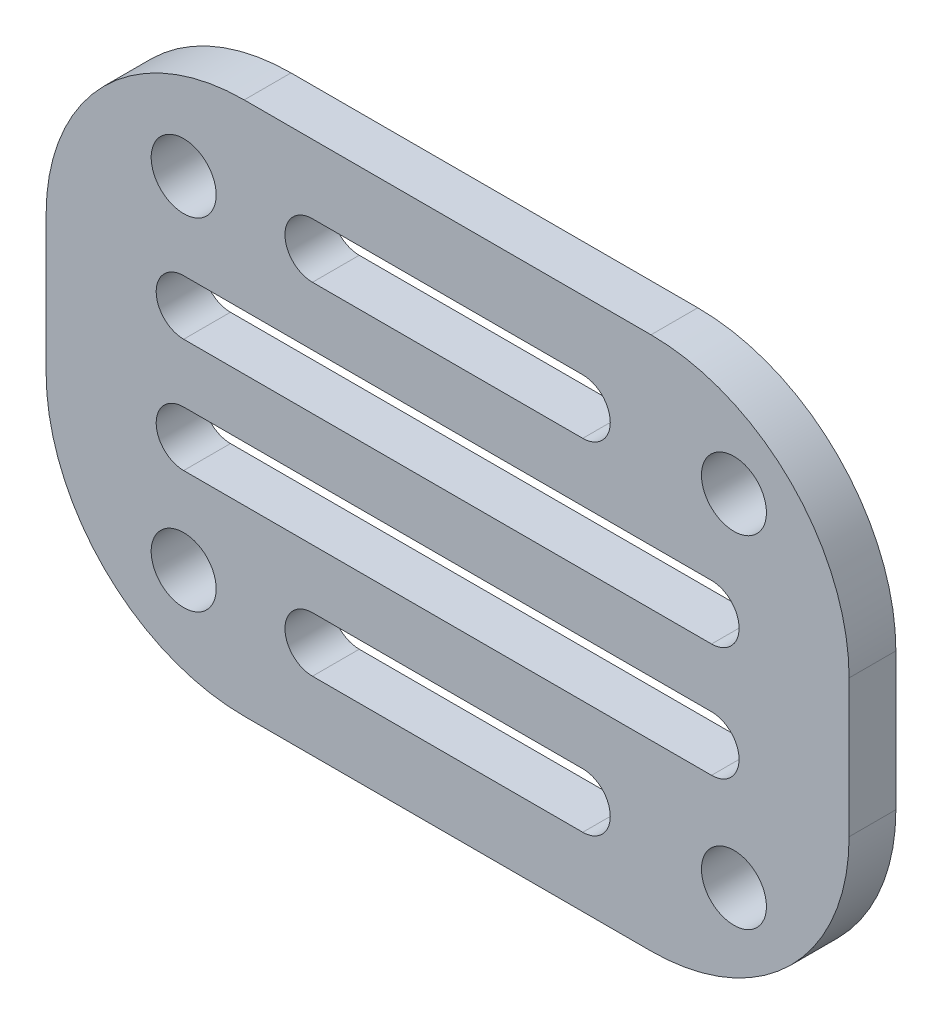
ISO-10303-21;
HEADER;
FILE_DESCRIPTION(('STEP AP214'),'2;1');
FILE_NAME('part.step','',(''),(''),'','','');
FILE_SCHEMA(('AUTOMOTIVE_DESIGN { 1 0 10303 214 1 1 1 1 }'));
ENDSEC;
DATA;
#1=APPLICATION_CONTEXT('core data for automotive mechanical design processes');
#2=APPLICATION_PROTOCOL_DEFINITION('international standard','automotive_design',2000,#1);
#3=PRODUCT_CONTEXT('',#1,'mechanical');
#4=PRODUCT('Part','Part','',(#3));
#5=PRODUCT_RELATED_PRODUCT_CATEGORY('part','',(#4));
#6=PRODUCT_DEFINITION_FORMATION('','',#4);
#7=PRODUCT_DEFINITION_CONTEXT('part definition',#1,'design');
#8=PRODUCT_DEFINITION('design','',#6,#7);
#9=PRODUCT_DEFINITION_SHAPE('','',#8);
#10=(LENGTH_UNIT() NAMED_UNIT(*) SI_UNIT(.MILLI.,.METRE.));
#11=(NAMED_UNIT(*) PLANE_ANGLE_UNIT() SI_UNIT($,.RADIAN.));
#12=(NAMED_UNIT(*) SI_UNIT($,.STERADIAN.) SOLID_ANGLE_UNIT());
#13=UNCERTAINTY_MEASURE_WITH_UNIT(LENGTH_MEASURE(1.E-05),#10,'distance_accuracy_value','');
#14=(GEOMETRIC_REPRESENTATION_CONTEXT(3) GLOBAL_UNCERTAINTY_ASSIGNED_CONTEXT((#13)) GLOBAL_UNIT_ASSIGNED_CONTEXT((#10,
#11,#12)) REPRESENTATION_CONTEXT('',''));
#15=CARTESIAN_POINT('',(0.,0.,0.));
#16=DIRECTION('',(0.,0.,1.));
#17=DIRECTION('',(1.,0.,0.));
#18=AXIS2_PLACEMENT_3D('',#15,#16,#17);
#19=CARTESIAN_POINT('',(-19.05,0.,2.159));
#20=DIRECTION('',(1.,0.,0.));
#21=DIRECTION('',(0.,0.,-1.));
#22=AXIS2_PLACEMENT_3D('',#19,#20,#21);
#23=PLANE('',#22);
#24=DIRECTION('',(0.,-1.,0.));
#25=VECTOR('',#24,1.);
#26=CARTESIAN_POINT('',(-19.05,0.,0.));
#27=LINE('',#26,#25);
#28=CARTESIAN_POINT('',(-19.05,3.17499999999999,0.));
#29=VERTEX_POINT('',#28);
#30=CARTESIAN_POINT('',(-19.05,-3.17499999999999,0.));
#31=VERTEX_POINT('',#30);
#32=EDGE_CURVE('E376',#29,#31,#27,.T.);
#33=ORIENTED_EDGE('',*,*,#32,.T.);
#34=DIRECTION('',(0.,0.,-1.));
#35=VECTOR('',#34,1.);
#36=CARTESIAN_POINT('',(-19.05,-3.17499999999999,2.159));
#37=LINE('',#36,#35);
#38=CARTESIAN_POINT('',(-19.05,-3.17499999999999,2.159));
#39=VERTEX_POINT('',#38);
#40=EDGE_CURVE('E11',#39,#31,#37,.T.);
#41=ORIENTED_EDGE('',*,*,#40,.F.);
#42=DIRECTION('',(0.,-1.,0.));
#43=VECTOR('',#42,1.);
#44=CARTESIAN_POINT('',(-19.05,0.,2.159));
#45=LINE('',#44,#43);
#46=CARTESIAN_POINT('',(-19.05,3.17499999999999,2.159));
#47=VERTEX_POINT('',#46);
#48=EDGE_CURVE('E344',#47,#39,#45,.T.);
#49=ORIENTED_EDGE('',*,*,#48,.F.);
#50=DIRECTION('',(0.,0.,-1.));
#51=VECTOR('',#50,1.);
#52=CARTESIAN_POINT('',(-19.05,3.17499999999999,2.159));
#53=LINE('',#52,#51);
#54=EDGE_CURVE('E364',#47,#29,#53,.T.);
#55=ORIENTED_EDGE('',*,*,#54,.T.);
#56=EDGE_LOOP('',(#33,#41,#49,#55));
#57=FACE_BOUND('',#56,.T.);
#58=ADVANCED_FACE('F36',(#57),#23,.F.);
#59=CARTESIAN_POINT('',(-9.906,-3.17499999999999,2.159));
#60=DIRECTION('',(0.,0.,-1.));
#61=DIRECTION('',(-1.,0.,0.));
#62=AXIS2_PLACEMENT_3D('',#59,#60,#61);
#63=CYLINDRICAL_SURFACE('',#62,9.144);
#64=CARTESIAN_POINT('',(-9.906,-3.17499999999999,0.));
#65=DIRECTION('',(0.,0.,1.));
#66=DIRECTION('',(1.,0.,0.));
#67=AXIS2_PLACEMENT_3D('',#64,#65,#66);
#68=CIRCLE('',#67,9.144);
#69=CARTESIAN_POINT('',(-9.906,-12.319,0.));
#70=VERTEX_POINT('',#69);
#71=EDGE_CURVE('E379',#31,#70,#68,.T.);
#72=ORIENTED_EDGE('',*,*,#71,.T.);
#73=DIRECTION('',(0.,0.,-1.));
#74=VECTOR('',#73,1.);
#75=CARTESIAN_POINT('',(-9.906,-12.319,2.159));
#76=LINE('',#75,#74);
#77=CARTESIAN_POINT('',(-9.906,-12.319,2.159));
#78=VERTEX_POINT('',#77);
#79=EDGE_CURVE('E44',#78,#70,#76,.T.);
#80=ORIENTED_EDGE('',*,*,#79,.F.);
#81=CARTESIAN_POINT('',(-9.906,-3.17499999999999,2.159));
#82=DIRECTION('',(0.,0.,1.));
#83=DIRECTION('',(1.,0.,0.));
#84=AXIS2_PLACEMENT_3D('',#81,#82,#83);
#85=CIRCLE('',#84,9.144);
#86=EDGE_CURVE('E347',#39,#78,#85,.T.);
#87=ORIENTED_EDGE('',*,*,#86,.F.);
#88=ORIENTED_EDGE('',*,*,#40,.T.);
#89=EDGE_LOOP('',(#72,#80,#87,#88));
#90=FACE_BOUND('',#89,.T.);
#91=ADVANCED_FACE('F430',(#90),#63,.T.);
#92=CARTESIAN_POINT('',(0.,-12.319,2.159));
#93=DIRECTION('',(0.,1.,0.));
#94=DIRECTION('',(0.,0.,1.));
#95=AXIS2_PLACEMENT_3D('',#92,#93,#94);
#96=PLANE('',#95);
#97=DIRECTION('',(1.,0.,0.));
#98=VECTOR('',#97,1.);
#99=CARTESIAN_POINT('',(0.,-12.319,0.));
#100=LINE('',#99,#98);
#101=CARTESIAN_POINT('',(8.87222580103292,-12.319,0.));
#102=VERTEX_POINT('',#101);
#103=EDGE_CURVE('E381',#70,#102,#100,.T.);
#104=ORIENTED_EDGE('',*,*,#103,.T.);
#105=DIRECTION('',(0.,0.,-1.));
#106=VECTOR('',#105,1.);
#107=CARTESIAN_POINT('',(8.87222580103292,-12.319,2.159));
#108=LINE('',#107,#106);
#109=CARTESIAN_POINT('',(8.87222580103292,-12.319,2.159));
#110=VERTEX_POINT('',#109);
#111=EDGE_CURVE('E406',#110,#102,#108,.T.);
#112=ORIENTED_EDGE('',*,*,#111,.F.);
#113=DIRECTION('',(1.,0.,0.));
#114=VECTOR('',#113,1.);
#115=CARTESIAN_POINT('',(0.,-12.319,2.159));
#116=LINE('',#115,#114);
#117=EDGE_CURVE('E349',#78,#110,#116,.T.);
#118=ORIENTED_EDGE('',*,*,#117,.F.);
#119=ORIENTED_EDGE('',*,*,#79,.T.);
#120=EDGE_LOOP('',(#104,#112,#118,#119));
#121=FACE_BOUND('',#120,.T.);
#122=ADVANCED_FACE('F413',(#121),#96,.F.);
#123=CARTESIAN_POINT('',(8.87222580103292,-3.175,2.159));
#124=DIRECTION('',(0.,0.,-1.));
#125=DIRECTION('',(-1.,0.,0.));
#126=AXIS2_PLACEMENT_3D('',#123,#124,#125);
#127=CYLINDRICAL_SURFACE('',#126,9.144);
#128=CARTESIAN_POINT('',(8.87222580103292,-3.175,0.));
#129=DIRECTION('',(0.,0.,1.));
#130=DIRECTION('',(1.,0.,0.));
#131=AXIS2_PLACEMENT_3D('',#128,#129,#130);
#132=CIRCLE('',#131,9.144);
#133=CARTESIAN_POINT('',(18.0162258010329,-3.175,0.));
#134=VERTEX_POINT('',#133);
#135=EDGE_CURVE('E383',#102,#134,#132,.T.);
#136=ORIENTED_EDGE('',*,*,#135,.T.);
#137=DIRECTION('',(0.,0.,-1.));
#138=VECTOR('',#137,1.);
#139=CARTESIAN_POINT('',(18.0162258010329,-3.175,2.159));
#140=LINE('',#139,#138);
#141=CARTESIAN_POINT('',(18.0162258010329,-3.175,2.159));
#142=VERTEX_POINT('',#141);
#143=EDGE_CURVE('E404',#142,#134,#140,.T.);
#144=ORIENTED_EDGE('',*,*,#143,.F.);
#145=CARTESIAN_POINT('',(8.87222580103292,-3.175,2.159));
#146=DIRECTION('',(0.,0.,1.));
#147=DIRECTION('',(1.,0.,0.));
#148=AXIS2_PLACEMENT_3D('',#145,#146,#147);
#149=CIRCLE('',#148,9.144);
#150=EDGE_CURVE('E351',#110,#142,#149,.T.);
#151=ORIENTED_EDGE('',*,*,#150,.F.);
#152=ORIENTED_EDGE('',*,*,#111,.T.);
#153=EDGE_LOOP('',(#136,#144,#151,#152));
#154=FACE_BOUND('',#153,.T.);
#155=ADVANCED_FACE('F422',(#154),#127,.T.);
#156=CARTESIAN_POINT('',(18.0162258010329,0.,2.159));
#157=DIRECTION('',(1.,0.,0.));
#158=DIRECTION('',(0.,0.,-1.));
#159=AXIS2_PLACEMENT_3D('',#156,#157,#158);
#160=PLANE('',#159);
#161=DIRECTION('',(0.,-1.,0.));
#162=VECTOR('',#161,1.);
#163=CARTESIAN_POINT('',(18.0162258010329,0.,0.));
#164=LINE('',#163,#162);
#165=CARTESIAN_POINT('',(18.0162258010329,3.175,0.));
#166=VERTEX_POINT('',#165);
#167=EDGE_CURVE('E386',#166,#134,#164,.T.);
#168=ORIENTED_EDGE('',*,*,#167,.F.);
#169=DIRECTION('',(0.,0.,-1.));
#170=VECTOR('',#169,1.);
#171=CARTESIAN_POINT('',(18.0162258010329,3.175,2.159));
#172=LINE('',#171,#170);
#173=CARTESIAN_POINT('',(18.0162258010329,3.175,2.159));
#174=VERTEX_POINT('',#173);
#175=EDGE_CURVE('E402',#174,#166,#172,.T.);
#176=ORIENTED_EDGE('',*,*,#175,.F.);
#177=DIRECTION('',(0.,-1.,0.));
#178=VECTOR('',#177,1.);
#179=CARTESIAN_POINT('',(18.0162258010329,0.,2.159));
#180=LINE('',#179,#178);
#181=EDGE_CURVE('E353',#174,#142,#180,.T.);
#182=ORIENTED_EDGE('',*,*,#181,.T.);
#183=ORIENTED_EDGE('',*,*,#143,.T.);
#184=EDGE_LOOP('',(#168,#176,#182,#183));
#185=FACE_BOUND('',#184,.T.);
#186=ADVANCED_FACE('F444',(#185),#160,.T.);
#187=CARTESIAN_POINT('',(8.87222580103292,3.175,2.159));
#188=DIRECTION('',(0.,0.,-1.));
#189=DIRECTION('',(-1.,0.,0.));
#190=AXIS2_PLACEMENT_3D('',#187,#188,#189);
#191=CYLINDRICAL_SURFACE('',#190,9.144);
#192=CARTESIAN_POINT('',(8.87222580103292,3.175,0.));
#193=DIRECTION('',(0.,0.,1.));
#194=DIRECTION('',(1.,0.,0.));
#195=AXIS2_PLACEMENT_3D('',#192,#193,#194);
#196=CIRCLE('',#195,9.144);
#197=CARTESIAN_POINT('',(8.87222580103292,12.319,0.));
#198=VERTEX_POINT('',#197);
#199=EDGE_CURVE('E389',#198,#166,#196,.F.);
#200=ORIENTED_EDGE('',*,*,#199,.F.);
#201=DIRECTION('',(0.,0.,-1.));
#202=VECTOR('',#201,1.);
#203=CARTESIAN_POINT('',(8.87222580103292,12.319,2.159));
#204=LINE('',#203,#202);
#205=CARTESIAN_POINT('',(8.87222580103292,12.319,2.159));
#206=VERTEX_POINT('',#205);
#207=EDGE_CURVE('E400',#206,#198,#204,.T.);
#208=ORIENTED_EDGE('',*,*,#207,.F.);
#209=CARTESIAN_POINT('',(8.87222580103292,3.175,2.159));
#210=DIRECTION('',(0.,0.,1.));
#211=DIRECTION('',(1.,0.,0.));
#212=AXIS2_PLACEMENT_3D('',#209,#210,#211);
#213=CIRCLE('',#212,9.144);
#214=EDGE_CURVE('E356',#206,#174,#213,.F.);
#215=ORIENTED_EDGE('',*,*,#214,.T.);
#216=ORIENTED_EDGE('',*,*,#175,.T.);
#217=EDGE_LOOP('',(#200,#208,#215,#216));
#218=FACE_BOUND('',#217,.T.);
#219=ADVANCED_FACE('F442',(#218),#191,.T.);
#220=CARTESIAN_POINT('',(0.,12.319,2.159));
#221=DIRECTION('',(0.,1.,0.));
#222=DIRECTION('',(0.,0.,1.));
#223=AXIS2_PLACEMENT_3D('',#220,#221,#222);
#224=PLANE('',#223);
#225=DIRECTION('',(1.,0.,0.));
#226=VECTOR('',#225,1.);
#227=CARTESIAN_POINT('',(0.,12.319,0.));
#228=LINE('',#227,#226);
#229=CARTESIAN_POINT('',(-9.906,12.319,0.));
#230=VERTEX_POINT('',#229);
#231=EDGE_CURVE('E392',#230,#198,#228,.T.);
#232=ORIENTED_EDGE('',*,*,#231,.F.);
#233=DIRECTION('',(0.,0.,-1.));
#234=VECTOR('',#233,1.);
#235=CARTESIAN_POINT('',(-9.906,12.319,2.159));
#236=LINE('',#235,#234);
#237=CARTESIAN_POINT('',(-9.906,12.319,2.159));
#238=VERTEX_POINT('',#237);
#239=EDGE_CURVE('E398',#238,#230,#236,.T.);
#240=ORIENTED_EDGE('',*,*,#239,.F.);
#241=DIRECTION('',(1.,0.,0.));
#242=VECTOR('',#241,1.);
#243=CARTESIAN_POINT('',(0.,12.319,2.159));
#244=LINE('',#243,#242);
#245=EDGE_CURVE('E359',#238,#206,#244,.T.);
#246=ORIENTED_EDGE('',*,*,#245,.T.);
#247=ORIENTED_EDGE('',*,*,#207,.T.);
#248=EDGE_LOOP('',(#232,#240,#246,#247));
#249=FACE_BOUND('',#248,.T.);
#250=ADVANCED_FACE('F437',(#249),#224,.T.);
#251=CARTESIAN_POINT('',(12.7,-7.874,2.159));
#252=DIRECTION('',(0.,0.,-1.));
#253=DIRECTION('',(-1.,0.,0.));
#254=AXIS2_PLACEMENT_3D('',#251,#252,#253);
#255=CYLINDRICAL_SURFACE('',#254,1.5);
#256=CARTESIAN_POINT('',(12.7,-7.874,2.159));
#257=DIRECTION('',(0.,0.,1.));
#258=DIRECTION('',(1.,0.,0.));
#259=AXIS2_PLACEMENT_3D('',#256,#257,#258);
#260=CIRCLE('',#259,1.5);
#261=CARTESIAN_POINT('',(14.2,-7.874,2.159));
#262=VERTEX_POINT('',#261);
#263=EDGE_CURVE('E341',#262,#262,#260,.T.);
#264=ORIENTED_EDGE('',*,*,#263,.T.);
#265=EDGE_LOOP('',(#264));
#266=FACE_BOUND('',#265,.T.);
#267=CARTESIAN_POINT('',(12.7,-7.874,0.));
#268=DIRECTION('',(0.,0.,1.));
#269=DIRECTION('',(1.,0.,0.));
#270=AXIS2_PLACEMENT_3D('',#267,#268,#269);
#271=CIRCLE('',#270,1.5);
#272=CARTESIAN_POINT('',(14.2,-7.874,0.));
#273=VERTEX_POINT('',#272);
#274=EDGE_CURVE('E373',#273,#273,#271,.T.);
#275=ORIENTED_EDGE('',*,*,#274,.F.);
#276=EDGE_LOOP('',(#275));
#277=FACE_BOUND('',#276,.T.);
#278=ADVANCED_FACE('F461',(#266,#277),#255,.F.);
#279=CARTESIAN_POINT('',(12.7,7.874,2.159));
#280=DIRECTION('',(0.,0.,-1.));
#281=DIRECTION('',(-1.,0.,0.));
#282=AXIS2_PLACEMENT_3D('',#279,#280,#281);
#283=CYLINDRICAL_SURFACE('',#282,1.5);
#284=CARTESIAN_POINT('',(12.7,7.874,2.159));
#285=DIRECTION('',(0.,0.,1.));
#286=DIRECTION('',(1.,0.,0.));
#287=AXIS2_PLACEMENT_3D('',#284,#285,#286);
#288=CIRCLE('',#287,1.5);
#289=CARTESIAN_POINT('',(14.2,7.874,2.159));
#290=VERTEX_POINT('',#289);
#291=EDGE_CURVE('E338',#290,#290,#288,.T.);
#292=ORIENTED_EDGE('',*,*,#291,.T.);
#293=EDGE_LOOP('',(#292));
#294=FACE_BOUND('',#293,.T.);
#295=CARTESIAN_POINT('',(12.7,7.874,0.));
#296=DIRECTION('',(0.,0.,1.));
#297=DIRECTION('',(1.,0.,0.));
#298=AXIS2_PLACEMENT_3D('',#295,#296,#297);
#299=CIRCLE('',#298,1.5);
#300=CARTESIAN_POINT('',(14.2,7.874,0.));
#301=VERTEX_POINT('',#300);
#302=EDGE_CURVE('E370',#301,#301,#299,.T.);
#303=ORIENTED_EDGE('',*,*,#302,.F.);
#304=EDGE_LOOP('',(#303));
#305=FACE_BOUND('',#304,.T.);
#306=ADVANCED_FACE('F464',(#294,#305),#283,.F.);
#307=CARTESIAN_POINT('',(-12.7,-7.874,2.159));
#308=DIRECTION('',(0.,0.,-1.));
#309=DIRECTION('',(-1.,0.,0.));
#310=AXIS2_PLACEMENT_3D('',#307,#308,#309);
#311=CYLINDRICAL_SURFACE('',#310,1.5);
#312=CARTESIAN_POINT('',(-12.7,-7.874,2.159));
#313=DIRECTION('',(0.,0.,1.));
#314=DIRECTION('',(1.,0.,0.));
#315=AXIS2_PLACEMENT_3D('',#312,#313,#314);
#316=CIRCLE('',#315,1.5);
#317=CARTESIAN_POINT('',(-11.2,-7.874,2.159));
#318=VERTEX_POINT('',#317);
#319=EDGE_CURVE('E334',#318,#318,#316,.T.);
#320=ORIENTED_EDGE('',*,*,#319,.T.);
#321=EDGE_LOOP('',(#320));
#322=FACE_BOUND('',#321,.T.);
#323=CARTESIAN_POINT('',(-12.7,-7.874,0.));
#324=DIRECTION('',(0.,0.,1.));
#325=DIRECTION('',(1.,0.,0.));
#326=AXIS2_PLACEMENT_3D('',#323,#324,#325);
#327=CIRCLE('',#326,1.5);
#328=CARTESIAN_POINT('',(-11.2,-7.874,0.));
#329=VERTEX_POINT('',#328);
#330=EDGE_CURVE('E367',#329,#329,#327,.T.);
#331=ORIENTED_EDGE('',*,*,#330,.F.);
#332=EDGE_LOOP('',(#331));
#333=FACE_BOUND('',#332,.T.);
#334=ADVANCED_FACE('F467',(#322,#333),#311,.F.);
#335=CARTESIAN_POINT('',(-12.7,7.874,2.159));
#336=DIRECTION('',(0.,0.,-1.));
#337=DIRECTION('',(-1.,0.,0.));
#338=AXIS2_PLACEMENT_3D('',#335,#336,#337);
#339=CYLINDRICAL_SURFACE('',#338,1.5);
#340=CARTESIAN_POINT('',(-12.7,7.874,2.159));
#341=DIRECTION('',(0.,0.,1.));
#342=DIRECTION('',(1.,0.,0.));
#343=AXIS2_PLACEMENT_3D('',#340,#341,#342);
#344=CIRCLE('',#343,1.5);
#345=CARTESIAN_POINT('',(-11.2,7.874,2.159));
#346=VERTEX_POINT('',#345);
#347=EDGE_CURVE('E331',#346,#346,#344,.T.);
#348=ORIENTED_EDGE('',*,*,#347,.T.);
#349=EDGE_LOOP('',(#348));
#350=FACE_BOUND('',#349,.T.);
#351=CARTESIAN_POINT('',(-12.7,7.874,0.));
#352=DIRECTION('',(0.,0.,1.));
#353=DIRECTION('',(1.,0.,0.));
#354=AXIS2_PLACEMENT_3D('',#351,#352,#353);
#355=CIRCLE('',#354,1.5);
#356=CARTESIAN_POINT('',(-11.2,7.874,0.));
#357=VERTEX_POINT('',#356);
#358=EDGE_CURVE('E234',#357,#357,#355,.T.);
#359=ORIENTED_EDGE('',*,*,#358,.F.);
#360=EDGE_LOOP('',(#359));
#361=FACE_BOUND('',#360,.T.);
#362=ADVANCED_FACE('F38',(#350,#361),#339,.F.);
#363=CARTESIAN_POINT('',(-9.906,3.17499999999999,2.159));
#364=DIRECTION('',(0.,0.,-1.));
#365=DIRECTION('',(-1.,0.,0.));
#366=AXIS2_PLACEMENT_3D('',#363,#364,#365);
#367=CYLINDRICAL_SURFACE('',#366,9.144);
#368=CARTESIAN_POINT('',(-9.906,3.17499999999999,0.));
#369=DIRECTION('',(0.,0.,1.));
#370=DIRECTION('',(1.,0.,0.));
#371=AXIS2_PLACEMENT_3D('',#368,#369,#370);
#372=CIRCLE('',#371,9.144);
#373=EDGE_CURVE('E335',#230,#29,#372,.T.);
#374=ORIENTED_EDGE('',*,*,#373,.T.);
#375=ORIENTED_EDGE('',*,*,#54,.F.);
#376=CARTESIAN_POINT('',(-9.906,3.17499999999999,2.159));
#377=DIRECTION('',(0.,0.,1.));
#378=DIRECTION('',(1.,0.,0.));
#379=AXIS2_PLACEMENT_3D('',#376,#377,#378);
#380=CIRCLE('',#379,9.144);
#381=EDGE_CURVE('E362',#238,#47,#380,.T.);
#382=ORIENTED_EDGE('',*,*,#381,.F.);
#383=ORIENTED_EDGE('',*,*,#239,.T.);
#384=EDGE_LOOP('',(#374,#375,#382,#383));
#385=FACE_BOUND('',#384,.T.);
#386=ADVANCED_FACE('F474',(#385),#367,.T.);
#387=CARTESIAN_POINT('',(0.,0.,2.159));
#388=DIRECTION('',(0.,0.,1.));
#389=DIRECTION('',(1.,0.,0.));
#390=AXIS2_PLACEMENT_3D('',#387,#388,#389);
#391=PLANE('',#390);
#392=CARTESIAN_POINT('',(-6.755,7.87399999999999,2.159));
#393=DIRECTION('',(0.,0.,1.));
#394=DIRECTION('',(1.,0.,0.));
#395=AXIS2_PLACEMENT_3D('',#392,#393,#394);
#396=CIRCLE('',#395,1.27);
#397=CARTESIAN_POINT('',(-6.755,9.14399999999999,2.159));
#398=VERTEX_POINT('',#397);
#399=CARTESIAN_POINT('',(-6.755,6.604,2.159));
#400=VERTEX_POINT('',#399);
#401=EDGE_CURVE('E51',#398,#400,#396,.T.);
#402=ORIENTED_EDGE('',*,*,#401,.F.);
#403=DIRECTION('',(-1.,0.,0.));
#404=VECTOR('',#403,1.);
#405=CARTESIAN_POINT('',(-6.755,9.14399999999999,2.159));
#406=LINE('',#405,#404);
#407=CARTESIAN_POINT('',(5.72122580103291,9.14399999999999,2.159));
#408=VERTEX_POINT('',#407);
#409=EDGE_CURVE('E218',#408,#398,#406,.T.);
#410=ORIENTED_EDGE('',*,*,#409,.F.);
#411=CARTESIAN_POINT('',(5.72122580103291,7.87399999999999,2.159));
#412=DIRECTION('',(0.,0.,1.));
#413=DIRECTION('',(1.,0.,0.));
#414=AXIS2_PLACEMENT_3D('',#411,#412,#413);
#415=CIRCLE('',#414,1.27);
#416=CARTESIAN_POINT('',(5.72122580103291,6.604,2.159));
#417=VERTEX_POINT('',#416);
#418=EDGE_CURVE('E221',#417,#408,#415,.T.);
#419=ORIENTED_EDGE('',*,*,#418,.F.);
#420=DIRECTION('',(1.,0.,0.));
#421=VECTOR('',#420,1.);
#422=CARTESIAN_POINT('',(-6.755,6.604,2.159));
#423=LINE('',#422,#421);
#424=EDGE_CURVE('E227',#400,#417,#423,.T.);
#425=ORIENTED_EDGE('',*,*,#424,.F.);
#426=EDGE_LOOP('',(#402,#410,#419,#425));
#427=FACE_BOUND('',#426,.T.);
#428=CARTESIAN_POINT('',(-12.7,2.62466666666666,2.159));
#429=DIRECTION('',(0.,0.,1.));
#430=DIRECTION('',(1.,0.,0.));
#431=AXIS2_PLACEMENT_3D('',#428,#429,#430);
#432=CIRCLE('',#431,1.27);
#433=CARTESIAN_POINT('',(-12.7,3.89466666666667,2.159));
#434=VERTEX_POINT('',#433);
#435=CARTESIAN_POINT('',(-12.7,1.35466666666666,2.159));
#436=VERTEX_POINT('',#435);
#437=EDGE_CURVE('E59',#434,#436,#432,.T.);
#438=ORIENTED_EDGE('',*,*,#437,.F.);
#439=DIRECTION('',(-1.,0.,0.));
#440=VECTOR('',#439,1.);
#441=CARTESIAN_POINT('',(-12.7,3.89466666666667,2.159));
#442=LINE('',#441,#440);
#443=CARTESIAN_POINT('',(11.6662258010329,3.89466666666667,2.159));
#444=VERTEX_POINT('',#443);
#445=EDGE_CURVE('E242',#444,#434,#442,.T.);
#446=ORIENTED_EDGE('',*,*,#445,.F.);
#447=CARTESIAN_POINT('',(11.6662258010329,2.62466666666667,2.159));
#448=DIRECTION('',(0.,0.,1.));
#449=DIRECTION('',(1.,0.,0.));
#450=AXIS2_PLACEMENT_3D('',#447,#448,#449);
#451=CIRCLE('',#450,1.27);
#452=CARTESIAN_POINT('',(11.6662258010329,1.35466666666667,2.159));
#453=VERTEX_POINT('',#452);
#454=EDGE_CURVE('E257',#453,#444,#451,.T.);
#455=ORIENTED_EDGE('',*,*,#454,.F.);
#456=DIRECTION('',(1.,0.,0.));
#457=VECTOR('',#456,1.);
#458=CARTESIAN_POINT('',(-12.7,1.35466666666666,2.159));
#459=LINE('',#458,#457);
#460=EDGE_CURVE('E253',#436,#453,#459,.T.);
#461=ORIENTED_EDGE('',*,*,#460,.F.);
#462=EDGE_LOOP('',(#438,#446,#455,#461));
#463=FACE_BOUND('',#462,.T.);
#464=CARTESIAN_POINT('',(-12.7,-2.62466666666666,2.159));
#465=DIRECTION('',(0.,0.,1.));
#466=DIRECTION('',(1.,0.,0.));
#467=AXIS2_PLACEMENT_3D('',#464,#465,#466);
#468=CIRCLE('',#467,1.27);
#469=CARTESIAN_POINT('',(-12.7,-1.35466666666666,2.159));
#470=VERTEX_POINT('',#469);
#471=CARTESIAN_POINT('',(-12.7,-3.89466666666666,2.159));
#472=VERTEX_POINT('',#471);
#473=EDGE_CURVE('E282',#470,#472,#468,.T.);
#474=ORIENTED_EDGE('',*,*,#473,.F.);
#475=DIRECTION('',(-1.,0.,0.));
#476=VECTOR('',#475,1.);
#477=CARTESIAN_POINT('',(-12.7,-1.35466666666666,2.159));
#478=LINE('',#477,#476);
#479=CARTESIAN_POINT('',(11.6662258010329,-1.35466666666666,2.159));
#480=VERTEX_POINT('',#479);
#481=EDGE_CURVE('E272',#480,#470,#478,.T.);
#482=ORIENTED_EDGE('',*,*,#481,.F.);
#483=CARTESIAN_POINT('',(11.6662258010329,-2.62466666666666,2.159));
#484=DIRECTION('',(0.,0.,1.));
#485=DIRECTION('',(1.,0.,0.));
#486=AXIS2_PLACEMENT_3D('',#483,#484,#485);
#487=CIRCLE('',#486,1.27);
#488=CARTESIAN_POINT('',(11.6662258010329,-3.89466666666666,2.159));
#489=VERTEX_POINT('',#488);
#490=EDGE_CURVE('E288',#489,#480,#487,.T.);
#491=ORIENTED_EDGE('',*,*,#490,.F.);
#492=DIRECTION('',(1.,0.,0.));
#493=VECTOR('',#492,1.);
#494=CARTESIAN_POINT('',(-12.7,-3.89466666666666,2.159));
#495=LINE('',#494,#493);
#496=EDGE_CURVE('E284',#472,#489,#495,.T.);
#497=ORIENTED_EDGE('',*,*,#496,.F.);
#498=EDGE_LOOP('',(#474,#482,#491,#497));
#499=FACE_BOUND('',#498,.T.);
#500=CARTESIAN_POINT('',(-6.75499999999999,-7.87399999999999,2.159));
#501=DIRECTION('',(0.,0.,1.));
#502=DIRECTION('',(1.,0.,0.));
#503=AXIS2_PLACEMENT_3D('',#500,#501,#502);
#504=CIRCLE('',#503,1.27);
#505=CARTESIAN_POINT('',(-6.75499999999999,-6.60399999999999,2.159));
#506=VERTEX_POINT('',#505);
#507=CARTESIAN_POINT('',(-6.75499999999999,-9.14399999999999,2.159));
#508=VERTEX_POINT('',#507);
#509=EDGE_CURVE('E314',#506,#508,#504,.T.);
#510=ORIENTED_EDGE('',*,*,#509,.F.);
#511=DIRECTION('',(-1.,0.,0.));
#512=VECTOR('',#511,1.);
#513=CARTESIAN_POINT('',(-6.75499999999999,-6.60399999999999,2.159));
#514=LINE('',#513,#512);
#515=CARTESIAN_POINT('',(5.72122580103291,-6.60399999999999,2.159));
#516=VERTEX_POINT('',#515);
#517=EDGE_CURVE('E304',#516,#506,#514,.T.);
#518=ORIENTED_EDGE('',*,*,#517,.F.);
#519=CARTESIAN_POINT('',(5.72122580103291,-7.87399999999999,2.159));
#520=DIRECTION('',(0.,0.,1.));
#521=DIRECTION('',(1.,0.,0.));
#522=AXIS2_PLACEMENT_3D('',#519,#520,#521);
#523=CIRCLE('',#522,1.27);
#524=CARTESIAN_POINT('',(5.72122580103292,-9.14399999999999,2.159));
#525=VERTEX_POINT('',#524);
#526=EDGE_CURVE('E319',#525,#516,#523,.T.);
#527=ORIENTED_EDGE('',*,*,#526,.F.);
#528=DIRECTION('',(1.,0.,0.));
#529=VECTOR('',#528,1.);
#530=CARTESIAN_POINT('',(-6.75499999999999,-9.14399999999999,2.159));
#531=LINE('',#530,#529);
#532=EDGE_CURVE('E316',#508,#525,#531,.T.);
#533=ORIENTED_EDGE('',*,*,#532,.F.);
#534=EDGE_LOOP('',(#510,#518,#527,#533));
#535=FACE_BOUND('',#534,.T.);
#536=ORIENTED_EDGE('',*,*,#347,.F.);
#537=EDGE_LOOP('',(#536));
#538=FACE_BOUND('',#537,.T.);
#539=ORIENTED_EDGE('',*,*,#319,.F.);
#540=EDGE_LOOP('',(#539));
#541=FACE_BOUND('',#540,.T.);
#542=ORIENTED_EDGE('',*,*,#291,.F.);
#543=EDGE_LOOP('',(#542));
#544=FACE_BOUND('',#543,.T.);
#545=ORIENTED_EDGE('',*,*,#263,.F.);
#546=EDGE_LOOP('',(#545));
#547=FACE_BOUND('',#546,.T.);
#548=ORIENTED_EDGE('',*,*,#48,.T.);
#549=ORIENTED_EDGE('',*,*,#86,.T.);
#550=ORIENTED_EDGE('',*,*,#117,.T.);
#551=ORIENTED_EDGE('',*,*,#150,.T.);
#552=ORIENTED_EDGE('',*,*,#181,.F.);
#553=ORIENTED_EDGE('',*,*,#214,.F.);
#554=ORIENTED_EDGE('',*,*,#245,.F.);
#555=ORIENTED_EDGE('',*,*,#381,.T.);
#556=EDGE_LOOP('',(#548,#549,#550,#551,#552,#553,#554,#555));
#557=FACE_BOUND('',#556,.T.);
#558=ADVANCED_FACE('F426',(#427,#463,#499,#535,#538,#541,#544,#547,#557),#391,.T.);
#559=CARTESIAN_POINT('',(0.,0.,0.));
#560=DIRECTION('',(0.,0.,1.));
#561=DIRECTION('',(1.,0.,0.));
#562=AXIS2_PLACEMENT_3D('',#559,#560,#561);
#563=PLANE('',#562);
#564=DIRECTION('',(-1.,0.,0.));
#565=VECTOR('',#564,1.);
#566=CARTESIAN_POINT('',(-6.755,9.14399999999999,0.));
#567=LINE('',#566,#565);
#568=CARTESIAN_POINT('',(5.72122580103291,9.14399999999999,0.));
#569=VERTEX_POINT('',#568);
#570=CARTESIAN_POINT('',(-6.755,9.14399999999999,0.));
#571=VERTEX_POINT('',#570);
#572=EDGE_CURVE('E205',#569,#571,#567,.T.);
#573=ORIENTED_EDGE('',*,*,#572,.T.);
#574=CARTESIAN_POINT('',(-6.755,7.87399999999999,0.));
#575=DIRECTION('',(0.,0.,1.));
#576=DIRECTION('',(1.,0.,0.));
#577=AXIS2_PLACEMENT_3D('',#574,#575,#576);
#578=CIRCLE('',#577,1.27);
#579=CARTESIAN_POINT('',(-6.755,6.604,0.));
#580=VERTEX_POINT('',#579);
#581=EDGE_CURVE('E199',#571,#580,#578,.T.);
#582=ORIENTED_EDGE('',*,*,#581,.T.);
#583=DIRECTION('',(1.,0.,0.));
#584=VECTOR('',#583,1.);
#585=CARTESIAN_POINT('',(-6.755,6.604,0.));
#586=LINE('',#585,#584);
#587=CARTESIAN_POINT('',(5.72122580103291,6.604,0.));
#588=VERTEX_POINT('',#587);
#589=EDGE_CURVE('E209',#580,#588,#586,.T.);
#590=ORIENTED_EDGE('',*,*,#589,.T.);
#591=CARTESIAN_POINT('',(5.72122580103291,7.87399999999999,0.));
#592=DIRECTION('',(0.,0.,1.));
#593=DIRECTION('',(1.,0.,0.));
#594=AXIS2_PLACEMENT_3D('',#591,#592,#593);
#595=CIRCLE('',#594,1.27);
#596=EDGE_CURVE('E213',#588,#569,#595,.T.);
#597=ORIENTED_EDGE('',*,*,#596,.T.);
#598=EDGE_LOOP('',(#573,#582,#590,#597));
#599=FACE_BOUND('',#598,.T.);
#600=DIRECTION('',(-1.,0.,0.));
#601=VECTOR('',#600,1.);
#602=CARTESIAN_POINT('',(-12.7,3.89466666666667,0.));
#603=LINE('',#602,#601);
#604=CARTESIAN_POINT('',(11.6662258010329,3.89466666666667,0.));
#605=VERTEX_POINT('',#604);
#606=CARTESIAN_POINT('',(-12.7,3.89466666666667,0.));
#607=VERTEX_POINT('',#606);
#608=EDGE_CURVE('E248',#605,#607,#603,.T.);
#609=ORIENTED_EDGE('',*,*,#608,.T.);
#610=CARTESIAN_POINT('',(-12.7,2.62466666666666,0.));
#611=DIRECTION('',(0.,0.,1.));
#612=DIRECTION('',(1.,0.,0.));
#613=AXIS2_PLACEMENT_3D('',#610,#611,#612);
#614=CIRCLE('',#613,1.27);
#615=CARTESIAN_POINT('',(-12.7,1.35466666666666,0.));
#616=VERTEX_POINT('',#615);
#617=EDGE_CURVE('E238',#607,#616,#614,.T.);
#618=ORIENTED_EDGE('',*,*,#617,.T.);
#619=DIRECTION('',(1.,0.,0.));
#620=VECTOR('',#619,1.);
#621=CARTESIAN_POINT('',(-12.7,1.35466666666666,0.));
#622=LINE('',#621,#620);
#623=CARTESIAN_POINT('',(11.6662258010329,1.35466666666667,0.));
#624=VERTEX_POINT('',#623);
#625=EDGE_CURVE('E241',#616,#624,#622,.T.);
#626=ORIENTED_EDGE('',*,*,#625,.T.);
#627=CARTESIAN_POINT('',(11.6662258010329,2.62466666666667,0.));
#628=DIRECTION('',(0.,0.,1.));
#629=DIRECTION('',(1.,0.,0.));
#630=AXIS2_PLACEMENT_3D('',#627,#628,#629);
#631=CIRCLE('',#630,1.27);
#632=EDGE_CURVE('E245',#624,#605,#631,.T.);
#633=ORIENTED_EDGE('',*,*,#632,.T.);
#634=EDGE_LOOP('',(#609,#618,#626,#633));
#635=FACE_BOUND('',#634,.T.);
#636=DIRECTION('',(-1.,0.,0.));
#637=VECTOR('',#636,1.);
#638=CARTESIAN_POINT('',(-12.7,-1.35466666666666,0.));
#639=LINE('',#638,#637);
#640=CARTESIAN_POINT('',(11.6662258010329,-1.35466666666666,0.));
#641=VERTEX_POINT('',#640);
#642=CARTESIAN_POINT('',(-12.7,-1.35466666666666,0.));
#643=VERTEX_POINT('',#642);
#644=EDGE_CURVE('E278',#641,#643,#639,.T.);
#645=ORIENTED_EDGE('',*,*,#644,.T.);
#646=CARTESIAN_POINT('',(-12.7,-2.62466666666666,0.));
#647=DIRECTION('',(0.,0.,1.));
#648=DIRECTION('',(1.,0.,0.));
#649=AXIS2_PLACEMENT_3D('',#646,#647,#648);
#650=CIRCLE('',#649,1.27);
#651=CARTESIAN_POINT('',(-12.7,-3.89466666666666,0.));
#652=VERTEX_POINT('',#651);
#653=EDGE_CURVE('E268',#643,#652,#650,.T.);
#654=ORIENTED_EDGE('',*,*,#653,.T.);
#655=DIRECTION('',(1.,0.,0.));
#656=VECTOR('',#655,1.);
#657=CARTESIAN_POINT('',(-12.7,-3.89466666666666,0.));
#658=LINE('',#657,#656);
#659=CARTESIAN_POINT('',(11.6662258010329,-3.89466666666666,0.));
#660=VERTEX_POINT('',#659);
#661=EDGE_CURVE('E271',#652,#660,#658,.T.);
#662=ORIENTED_EDGE('',*,*,#661,.T.);
#663=CARTESIAN_POINT('',(11.6662258010329,-2.62466666666666,0.));
#664=DIRECTION('',(0.,0.,1.));
#665=DIRECTION('',(1.,0.,0.));
#666=AXIS2_PLACEMENT_3D('',#663,#664,#665);
#667=CIRCLE('',#666,1.27);
#668=EDGE_CURVE('E275',#660,#641,#667,.T.);
#669=ORIENTED_EDGE('',*,*,#668,.T.);
#670=EDGE_LOOP('',(#645,#654,#662,#669));
#671=FACE_BOUND('',#670,.T.);
#672=DIRECTION('',(-1.,0.,0.));
#673=VECTOR('',#672,1.);
#674=CARTESIAN_POINT('',(-6.75499999999999,-6.60399999999999,0.));
#675=LINE('',#674,#673);
#676=CARTESIAN_POINT('',(5.72122580103291,-6.60399999999999,0.));
#677=VERTEX_POINT('',#676);
#678=CARTESIAN_POINT('',(-6.75499999999999,-6.60399999999999,0.));
#679=VERTEX_POINT('',#678);
#680=EDGE_CURVE('E310',#677,#679,#675,.T.);
#681=ORIENTED_EDGE('',*,*,#680,.T.);
#682=CARTESIAN_POINT('',(-6.75499999999999,-7.87399999999999,0.));
#683=DIRECTION('',(0.,0.,1.));
#684=DIRECTION('',(1.,0.,0.));
#685=AXIS2_PLACEMENT_3D('',#682,#683,#684);
#686=CIRCLE('',#685,1.27);
#687=CARTESIAN_POINT('',(-6.75499999999999,-9.14399999999999,0.));
#688=VERTEX_POINT('',#687);
#689=EDGE_CURVE('E300',#679,#688,#686,.T.);
#690=ORIENTED_EDGE('',*,*,#689,.T.);
#691=DIRECTION('',(1.,0.,0.));
#692=VECTOR('',#691,1.);
#693=CARTESIAN_POINT('',(-6.75499999999999,-9.14399999999999,0.));
#694=LINE('',#693,#692);
#695=CARTESIAN_POINT('',(5.72122580103292,-9.14399999999999,0.));
#696=VERTEX_POINT('',#695);
#697=EDGE_CURVE('E303',#688,#696,#694,.T.);
#698=ORIENTED_EDGE('',*,*,#697,.T.);
#699=CARTESIAN_POINT('',(5.72122580103291,-7.87399999999999,0.));
#700=DIRECTION('',(0.,0.,1.));
#701=DIRECTION('',(1.,0.,0.));
#702=AXIS2_PLACEMENT_3D('',#699,#700,#701);
#703=CIRCLE('',#702,1.27);
#704=EDGE_CURVE('E307',#696,#677,#703,.T.);
#705=ORIENTED_EDGE('',*,*,#704,.T.);
#706=EDGE_LOOP('',(#681,#690,#698,#705));
#707=FACE_BOUND('',#706,.T.);
#708=ORIENTED_EDGE('',*,*,#358,.T.);
#709=EDGE_LOOP('',(#708));
#710=FACE_BOUND('',#709,.T.);
#711=ORIENTED_EDGE('',*,*,#330,.T.);
#712=EDGE_LOOP('',(#711));
#713=FACE_BOUND('',#712,.T.);
#714=ORIENTED_EDGE('',*,*,#302,.T.);
#715=EDGE_LOOP('',(#714));
#716=FACE_BOUND('',#715,.T.);
#717=ORIENTED_EDGE('',*,*,#274,.T.);
#718=EDGE_LOOP('',(#717));
#719=FACE_BOUND('',#718,.T.);
#720=ORIENTED_EDGE('',*,*,#32,.F.);
#721=ORIENTED_EDGE('',*,*,#373,.F.);
#722=ORIENTED_EDGE('',*,*,#231,.T.);
#723=ORIENTED_EDGE('',*,*,#199,.T.);
#724=ORIENTED_EDGE('',*,*,#167,.T.);
#725=ORIENTED_EDGE('',*,*,#135,.F.);
#726=ORIENTED_EDGE('',*,*,#103,.F.);
#727=ORIENTED_EDGE('',*,*,#71,.F.);
#728=EDGE_LOOP('',(#720,#721,#722,#723,#724,#725,#726,#727));
#729=FACE_BOUND('',#728,.T.);
#730=ADVANCED_FACE('F215',(#599,#635,#671,#707,#710,#713,#716,#719,#729),#563,.F.);
#731=CARTESIAN_POINT('',(-6.75499999999999,-7.87399999999999,0.));
#732=DIRECTION('',(0.,0.,1.));
#733=DIRECTION('',(1.,0.,0.));
#734=AXIS2_PLACEMENT_3D('',#731,#732,#733);
#735=CYLINDRICAL_SURFACE('',#734,1.27);
#736=ORIENTED_EDGE('',*,*,#509,.T.);
#737=DIRECTION('',(0.,0.,1.));
#738=VECTOR('',#737,1.);
#739=CARTESIAN_POINT('',(-6.75499999999999,-9.14399999999999,0.));
#740=LINE('',#739,#738);
#741=EDGE_CURVE('E313',#688,#508,#740,.T.);
#742=ORIENTED_EDGE('',*,*,#741,.F.);
#743=ORIENTED_EDGE('',*,*,#689,.F.);
#744=DIRECTION('',(0.,0.,1.));
#745=VECTOR('',#744,1.);
#746=CARTESIAN_POINT('',(-6.75499999999999,-6.60399999999999,0.));
#747=LINE('',#746,#745);
#748=EDGE_CURVE('E285',#679,#506,#747,.T.);
#749=ORIENTED_EDGE('',*,*,#748,.T.);
#750=EDGE_LOOP('',(#736,#742,#743,#749));
#751=FACE_BOUND('',#750,.T.);
#752=ADVANCED_FACE('F482',(#751),#735,.F.);
#753=CARTESIAN_POINT('',(-6.75499999999999,-6.60399999999999,0.));
#754=DIRECTION('',(0.,1.,0.));
#755=DIRECTION('',(-1.,0.,0.));
#756=AXIS2_PLACEMENT_3D('',#753,#754,#755);
#757=PLANE('',#756);
#758=ORIENTED_EDGE('',*,*,#517,.T.);
#759=ORIENTED_EDGE('',*,*,#748,.F.);
#760=ORIENTED_EDGE('',*,*,#680,.F.);
#761=DIRECTION('',(0.,0.,1.));
#762=VECTOR('',#761,1.);
#763=CARTESIAN_POINT('',(5.72122580103291,-6.60399999999999,0.));
#764=LINE('',#763,#762);
#765=EDGE_CURVE('E325',#677,#516,#764,.T.);
#766=ORIENTED_EDGE('',*,*,#765,.T.);
#767=EDGE_LOOP('',(#758,#759,#760,#766));
#768=FACE_BOUND('',#767,.T.);
#769=ADVANCED_FACE('F493',(#768),#757,.F.);
#770=CARTESIAN_POINT('',(5.72122580103291,-7.87399999999999,0.));
#771=DIRECTION('',(0.,0.,1.));
#772=DIRECTION('',(1.,0.,0.));
#773=AXIS2_PLACEMENT_3D('',#770,#771,#772);
#774=CYLINDRICAL_SURFACE('',#773,1.27);
#775=ORIENTED_EDGE('',*,*,#526,.T.);
#776=ORIENTED_EDGE('',*,*,#765,.F.);
#777=ORIENTED_EDGE('',*,*,#704,.F.);
#778=DIRECTION('',(0.,0.,1.));
#779=VECTOR('',#778,1.);
#780=CARTESIAN_POINT('',(5.72122580103292,-9.14399999999999,0.));
#781=LINE('',#780,#779);
#782=EDGE_CURVE('E327',#696,#525,#781,.T.);
#783=ORIENTED_EDGE('',*,*,#782,.T.);
#784=EDGE_LOOP('',(#775,#776,#777,#783));
#785=FACE_BOUND('',#784,.T.);
#786=ADVANCED_FACE('F555',(#785),#774,.F.);
#787=CARTESIAN_POINT('',(-6.75499999999999,-9.14399999999999,0.));
#788=DIRECTION('',(0.,-1.,0.));
#789=DIRECTION('',(1.,0.,0.));
#790=AXIS2_PLACEMENT_3D('',#787,#788,#789);
#791=PLANE('',#790);
#792=ORIENTED_EDGE('',*,*,#532,.T.);
#793=ORIENTED_EDGE('',*,*,#782,.F.);
#794=ORIENTED_EDGE('',*,*,#697,.F.);
#795=ORIENTED_EDGE('',*,*,#741,.T.);
#796=EDGE_LOOP('',(#792,#793,#794,#795));
#797=FACE_BOUND('',#796,.T.);
#798=ADVANCED_FACE('F565',(#797),#791,.F.);
#799=CARTESIAN_POINT('',(-12.7,-2.62466666666666,0.));
#800=DIRECTION('',(0.,0.,1.));
#801=DIRECTION('',(1.,0.,0.));
#802=AXIS2_PLACEMENT_3D('',#799,#800,#801);
#803=CYLINDRICAL_SURFACE('',#802,1.27);
#804=ORIENTED_EDGE('',*,*,#473,.T.);
#805=DIRECTION('',(0.,0.,1.));
#806=VECTOR('',#805,1.);
#807=CARTESIAN_POINT('',(-12.7,-3.89466666666666,0.));
#808=LINE('',#807,#806);
#809=EDGE_CURVE('E281',#652,#472,#808,.T.);
#810=ORIENTED_EDGE('',*,*,#809,.F.);
#811=ORIENTED_EDGE('',*,*,#653,.F.);
#812=DIRECTION('',(0.,0.,1.));
#813=VECTOR('',#812,1.);
#814=CARTESIAN_POINT('',(-12.7,-1.35466666666666,0.));
#815=LINE('',#814,#813);
#816=EDGE_CURVE('E254',#643,#470,#815,.T.);
#817=ORIENTED_EDGE('',*,*,#816,.T.);
#818=EDGE_LOOP('',(#804,#810,#811,#817));
#819=FACE_BOUND('',#818,.T.);
#820=ADVANCED_FACE('F575',(#819),#803,.F.);
#821=CARTESIAN_POINT('',(-12.7,-1.35466666666666,0.));
#822=DIRECTION('',(0.,1.,0.));
#823=DIRECTION('',(-1.,0.,0.));
#824=AXIS2_PLACEMENT_3D('',#821,#822,#823);
#825=PLANE('',#824);
#826=ORIENTED_EDGE('',*,*,#481,.T.);
#827=ORIENTED_EDGE('',*,*,#816,.F.);
#828=ORIENTED_EDGE('',*,*,#644,.F.);
#829=DIRECTION('',(0.,0.,1.));
#830=VECTOR('',#829,1.);
#831=CARTESIAN_POINT('',(11.6662258010329,-1.35466666666666,0.));
#832=LINE('',#831,#830);
#833=EDGE_CURVE('E294',#641,#480,#832,.T.);
#834=ORIENTED_EDGE('',*,*,#833,.T.);
#835=EDGE_LOOP('',(#826,#827,#828,#834));
#836=FACE_BOUND('',#835,.T.);
#837=ADVANCED_FACE('F585',(#836),#825,.F.);
#838=CARTESIAN_POINT('',(11.6662258010329,-2.62466666666666,0.));
#839=DIRECTION('',(0.,0.,1.));
#840=DIRECTION('',(1.,0.,0.));
#841=AXIS2_PLACEMENT_3D('',#838,#839,#840);
#842=CYLINDRICAL_SURFACE('',#841,1.27);
#843=ORIENTED_EDGE('',*,*,#490,.T.);
#844=ORIENTED_EDGE('',*,*,#833,.F.);
#845=ORIENTED_EDGE('',*,*,#668,.F.);
#846=DIRECTION('',(0.,0.,1.));
#847=VECTOR('',#846,1.);
#848=CARTESIAN_POINT('',(11.6662258010329,-3.89466666666666,0.));
#849=LINE('',#848,#847);
#850=EDGE_CURVE('E296',#660,#489,#849,.T.);
#851=ORIENTED_EDGE('',*,*,#850,.T.);
#852=EDGE_LOOP('',(#843,#844,#845,#851));
#853=FACE_BOUND('',#852,.T.);
#854=ADVANCED_FACE('F595',(#853),#842,.F.);
#855=CARTESIAN_POINT('',(-12.7,-3.89466666666666,0.));
#856=DIRECTION('',(0.,-1.,0.));
#857=DIRECTION('',(1.,0.,0.));
#858=AXIS2_PLACEMENT_3D('',#855,#856,#857);
#859=PLANE('',#858);
#860=ORIENTED_EDGE('',*,*,#496,.T.);
#861=ORIENTED_EDGE('',*,*,#850,.F.);
#862=ORIENTED_EDGE('',*,*,#661,.F.);
#863=ORIENTED_EDGE('',*,*,#809,.T.);
#864=EDGE_LOOP('',(#860,#861,#862,#863));
#865=FACE_BOUND('',#864,.T.);
#866=ADVANCED_FACE('F605',(#865),#859,.F.);
#867=CARTESIAN_POINT('',(-12.7,2.62466666666666,0.));
#868=DIRECTION('',(0.,0.,1.));
#869=DIRECTION('',(1.,0.,0.));
#870=AXIS2_PLACEMENT_3D('',#867,#868,#869);
#871=CYLINDRICAL_SURFACE('',#870,1.27);
#872=ORIENTED_EDGE('',*,*,#437,.T.);
#873=DIRECTION('',(0.,0.,1.));
#874=VECTOR('',#873,1.);
#875=CARTESIAN_POINT('',(-12.7,1.35466666666666,0.));
#876=LINE('',#875,#874);
#877=EDGE_CURVE('E251',#616,#436,#876,.T.);
#878=ORIENTED_EDGE('',*,*,#877,.F.);
#879=ORIENTED_EDGE('',*,*,#617,.F.);
#880=DIRECTION('',(0.,0.,1.));
#881=VECTOR('',#880,1.);
#882=CARTESIAN_POINT('',(-12.7,3.89466666666667,0.));
#883=LINE('',#882,#881);
#884=EDGE_CURVE('E228',#607,#434,#883,.T.);
#885=ORIENTED_EDGE('',*,*,#884,.T.);
#886=EDGE_LOOP('',(#872,#878,#879,#885));
#887=FACE_BOUND('',#886,.T.);
#888=ADVANCED_FACE('F615',(#887),#871,.F.);
#889=CARTESIAN_POINT('',(-12.7,3.89466666666667,0.));
#890=DIRECTION('',(0.,1.,0.));
#891=DIRECTION('',(-1.,0.,0.));
#892=AXIS2_PLACEMENT_3D('',#889,#890,#891);
#893=PLANE('',#892);
#894=ORIENTED_EDGE('',*,*,#445,.T.);
#895=ORIENTED_EDGE('',*,*,#884,.F.);
#896=ORIENTED_EDGE('',*,*,#608,.F.);
#897=DIRECTION('',(0.,0.,1.));
#898=VECTOR('',#897,1.);
#899=CARTESIAN_POINT('',(11.6662258010329,3.89466666666667,0.));
#900=LINE('',#899,#898);
#901=EDGE_CURVE('E263',#605,#444,#900,.T.);
#902=ORIENTED_EDGE('',*,*,#901,.T.);
#903=EDGE_LOOP('',(#894,#895,#896,#902));
#904=FACE_BOUND('',#903,.T.);
#905=ADVANCED_FACE('F625',(#904),#893,.F.);
#906=CARTESIAN_POINT('',(11.6662258010329,2.62466666666667,0.));
#907=DIRECTION('',(0.,0.,1.));
#908=DIRECTION('',(1.,0.,0.));
#909=AXIS2_PLACEMENT_3D('',#906,#907,#908);
#910=CYLINDRICAL_SURFACE('',#909,1.27);
#911=ORIENTED_EDGE('',*,*,#454,.T.);
#912=ORIENTED_EDGE('',*,*,#901,.F.);
#913=ORIENTED_EDGE('',*,*,#632,.F.);
#914=DIRECTION('',(0.,0.,1.));
#915=VECTOR('',#914,1.);
#916=CARTESIAN_POINT('',(11.6662258010329,1.35466666666667,0.));
#917=LINE('',#916,#915);
#918=EDGE_CURVE('E265',#624,#453,#917,.T.);
#919=ORIENTED_EDGE('',*,*,#918,.T.);
#920=EDGE_LOOP('',(#911,#912,#913,#919));
#921=FACE_BOUND('',#920,.T.);
#922=ADVANCED_FACE('F634',(#921),#910,.F.);
#923=CARTESIAN_POINT('',(-12.7,1.35466666666666,0.));
#924=DIRECTION('',(0.,-1.,0.));
#925=DIRECTION('',(1.,0.,0.));
#926=AXIS2_PLACEMENT_3D('',#923,#924,#925);
#927=PLANE('',#926);
#928=ORIENTED_EDGE('',*,*,#460,.T.);
#929=ORIENTED_EDGE('',*,*,#918,.F.);
#930=ORIENTED_EDGE('',*,*,#625,.F.);
#931=ORIENTED_EDGE('',*,*,#877,.T.);
#932=EDGE_LOOP('',(#928,#929,#930,#931));
#933=FACE_BOUND('',#932,.T.);
#934=ADVANCED_FACE('F644',(#933),#927,.F.);
#935=CARTESIAN_POINT('',(-6.755,7.87399999999999,0.));
#936=DIRECTION('',(0.,0.,1.));
#937=DIRECTION('',(1.,0.,0.));
#938=AXIS2_PLACEMENT_3D('',#935,#936,#937);
#939=CYLINDRICAL_SURFACE('',#938,1.27);
#940=ORIENTED_EDGE('',*,*,#401,.T.);
#941=DIRECTION('',(0.,0.,1.));
#942=VECTOR('',#941,1.);
#943=CARTESIAN_POINT('',(-6.755,6.604,0.));
#944=LINE('',#943,#942);
#945=EDGE_CURVE('E195',#580,#400,#944,.T.);
#946=ORIENTED_EDGE('',*,*,#945,.F.);
#947=ORIENTED_EDGE('',*,*,#581,.F.);
#948=DIRECTION('',(0.,0.,1.));
#949=VECTOR('',#948,1.);
#950=CARTESIAN_POINT('',(-6.755,9.14399999999999,0.));
#951=LINE('',#950,#949);
#952=EDGE_CURVE('E232',#571,#398,#951,.T.);
#953=ORIENTED_EDGE('',*,*,#952,.T.);
#954=EDGE_LOOP('',(#940,#946,#947,#953));
#955=FACE_BOUND('',#954,.T.);
#956=ADVANCED_FACE('F197',(#955),#939,.F.);
#957=CARTESIAN_POINT('',(-6.755,9.14399999999999,0.));
#958=DIRECTION('',(0.,1.,0.));
#959=DIRECTION('',(-1.,0.,0.));
#960=AXIS2_PLACEMENT_3D('',#957,#958,#959);
#961=PLANE('',#960);
#962=ORIENTED_EDGE('',*,*,#409,.T.);
#963=ORIENTED_EDGE('',*,*,#952,.F.);
#964=ORIENTED_EDGE('',*,*,#572,.F.);
#965=DIRECTION('',(0.,0.,1.));
#966=VECTOR('',#965,1.);
#967=CARTESIAN_POINT('',(5.72122580103291,9.14399999999999,0.));
#968=LINE('',#967,#966);
#969=EDGE_CURVE('E235',#569,#408,#968,.T.);
#970=ORIENTED_EDGE('',*,*,#969,.T.);
#971=EDGE_LOOP('',(#962,#963,#964,#970));
#972=FACE_BOUND('',#971,.T.);
#973=ADVANCED_FACE('F663',(#972),#961,.F.);
#974=CARTESIAN_POINT('',(5.72122580103291,7.87399999999999,0.));
#975=DIRECTION('',(0.,0.,1.));
#976=DIRECTION('',(1.,0.,0.));
#977=AXIS2_PLACEMENT_3D('',#974,#975,#976);
#978=CYLINDRICAL_SURFACE('',#977,1.27);
#979=ORIENTED_EDGE('',*,*,#418,.T.);
#980=ORIENTED_EDGE('',*,*,#969,.F.);
#981=ORIENTED_EDGE('',*,*,#596,.F.);
#982=DIRECTION('',(0.,0.,1.));
#983=VECTOR('',#982,1.);
#984=CARTESIAN_POINT('',(5.72122580103291,6.604,0.));
#985=LINE('',#984,#983);
#986=EDGE_CURVE('E204',#588,#417,#985,.T.);
#987=ORIENTED_EDGE('',*,*,#986,.T.);
#988=EDGE_LOOP('',(#979,#980,#981,#987));
#989=FACE_BOUND('',#988,.T.);
#990=ADVANCED_FACE('F672',(#989),#978,.F.);
#991=CARTESIAN_POINT('',(-6.755,6.604,0.));
#992=DIRECTION('',(0.,-1.,0.));
#993=DIRECTION('',(1.,0.,0.));
#994=AXIS2_PLACEMENT_3D('',#991,#992,#993);
#995=PLANE('',#994);
#996=ORIENTED_EDGE('',*,*,#424,.T.);
#997=ORIENTED_EDGE('',*,*,#986,.F.);
#998=ORIENTED_EDGE('',*,*,#589,.F.);
#999=ORIENTED_EDGE('',*,*,#945,.T.);
#1000=EDGE_LOOP('',(#996,#997,#998,#999));
#1001=FACE_BOUND('',#1000,.T.);
#1002=ADVANCED_FACE('F210',(#1001),#995,.F.);
#1003=CLOSED_SHELL('',(#58,#91,#122,#155,#186,#219,#250,#278,#306,#334,#362,#386,#558,#730,#752,
#769,#786,#798,#820,#837,#854,#866,#888,#905,#922,#934,#956,#973,#990,#1002));
#1004=MANIFOLD_SOLID_BREP('B2',#1003);
#1005=ADVANCED_BREP_SHAPE_REPRESENTATION('',(#18,#1004),#14);
#1006=SHAPE_DEFINITION_REPRESENTATION(#9,#1005);
ENDSEC;
END-ISO-10303-21;
